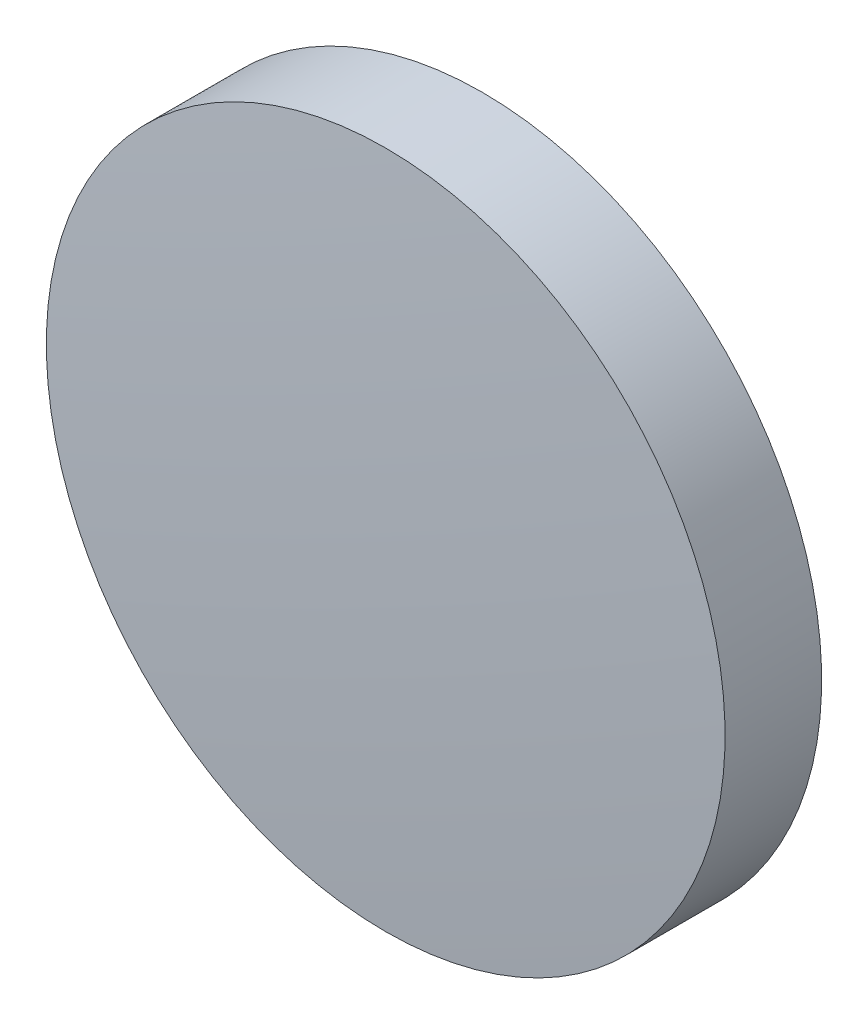
ISO-10303-21;
HEADER;
FILE_DESCRIPTION(('STEP AP214'),'2;1');
FILE_NAME('part.step','',(''),(''),'','','');
FILE_SCHEMA(('AUTOMOTIVE_DESIGN { 1 0 10303 214 1 1 1 1 }'));
ENDSEC;
DATA;
#1=APPLICATION_CONTEXT('core data for automotive mechanical design processes');
#2=APPLICATION_PROTOCOL_DEFINITION('international standard','automotive_design',2000,#1);
#3=PRODUCT_CONTEXT('',#1,'mechanical');
#4=PRODUCT('Part','Part','',(#3));
#5=PRODUCT_RELATED_PRODUCT_CATEGORY('part','',(#4));
#6=PRODUCT_DEFINITION_FORMATION('','',#4);
#7=PRODUCT_DEFINITION_CONTEXT('part definition',#1,'design');
#8=PRODUCT_DEFINITION('design','',#6,#7);
#9=PRODUCT_DEFINITION_SHAPE('','',#8);
#10=(LENGTH_UNIT() NAMED_UNIT(*) SI_UNIT(.MILLI.,.METRE.));
#11=(NAMED_UNIT(*) PLANE_ANGLE_UNIT() SI_UNIT($,.RADIAN.));
#12=(NAMED_UNIT(*) SI_UNIT($,.STERADIAN.) SOLID_ANGLE_UNIT());
#13=UNCERTAINTY_MEASURE_WITH_UNIT(LENGTH_MEASURE(1.E-05),#10,'distance_accuracy_value','');
#14=(GEOMETRIC_REPRESENTATION_CONTEXT(3) GLOBAL_UNCERTAINTY_ASSIGNED_CONTEXT((#13)) GLOBAL_UNIT_ASSIGNED_CONTEXT((#10,
#11,#12)) REPRESENTATION_CONTEXT('',''));
#15=CARTESIAN_POINT('',(0.,0.,0.));
#16=DIRECTION('',(0.,0.,1.));
#17=DIRECTION('',(1.,0.,0.));
#18=AXIS2_PLACEMENT_3D('',#15,#16,#17);
#19=CARTESIAN_POINT('',(0.,0.,-2.));
#20=DIRECTION('',(0.,0.,-1.));
#21=DIRECTION('',(0.,1.,0.));
#22=AXIS2_PLACEMENT_3D('',#19,#20,#21);
#23=PLANE('',#22);
#24=CARTESIAN_POINT('',(0.,0.,-2.));
#25=DIRECTION('',(0.,0.,-1.));
#26=DIRECTION('',(0.,1.,0.));
#27=AXIS2_PLACEMENT_3D('',#24,#25,#26);
#28=CIRCLE('',#27,12.7);
#29=CARTESIAN_POINT('',(0.,12.7,-2.));
#30=VERTEX_POINT('',#29);
#31=EDGE_CURVE('E36',#30,#30,#28,.T.);
#32=ORIENTED_EDGE('',*,*,#31,.T.);
#33=EDGE_LOOP('',(#32));
#34=FACE_BOUND('',#33,.T.);
#35=ADVANCED_FACE('F30',(#34),#23,.T.);
#36=CARTESIAN_POINT('',(0.,0.,-207.));
#37=DIRECTION('',(0.,0.,-1.));
#38=DIRECTION('',(0.,1.,0.));
#39=AXIS2_PLACEMENT_3D('',#36,#37,#38);
#40=SPHERICAL_SURFACE('',#39,209.);
#41=CARTESIAN_POINT('',(0.,0.,1.61378190330588));
#42=DIRECTION('',(0.,0.,-1.));
#43=DIRECTION('',(0.,1.,0.));
#44=AXIS2_PLACEMENT_3D('',#41,#42,#43);
#45=CIRCLE('',#44,12.7);
#46=CARTESIAN_POINT('',(0.,12.7,1.61378190330588));
#47=VERTEX_POINT('',#46);
#48=EDGE_CURVE('E10',#47,#47,#45,.T.);
#49=ORIENTED_EDGE('',*,*,#48,.F.);
#50=EDGE_LOOP('',(#49));
#51=FACE_BOUND('',#50,.T.);
#52=ADVANCED_FACE('F45',(#51),#40,.T.);
#53=CARTESIAN_POINT('',(0.,0.,-2.));
#54=DIRECTION('',(0.,0.,-1.));
#55=DIRECTION('',(0.,1.,0.));
#56=AXIS2_PLACEMENT_3D('',#53,#54,#55);
#57=CYLINDRICAL_SURFACE('',#56,12.7);
#58=ORIENTED_EDGE('',*,*,#48,.T.);
#59=EDGE_LOOP('',(#58));
#60=FACE_BOUND('',#59,.T.);
#61=ORIENTED_EDGE('',*,*,#31,.F.);
#62=EDGE_LOOP('',(#61));
#63=FACE_BOUND('',#62,.T.);
#64=ADVANCED_FACE('F43',(#60,#63),#57,.T.);
#65=CLOSED_SHELL('',(#35,#52,#64));
#66=MANIFOLD_SOLID_BREP('B2',#65);
#67=ADVANCED_BREP_SHAPE_REPRESENTATION('',(#18,#66),#14);
#68=SHAPE_DEFINITION_REPRESENTATION(#9,#67);
ENDSEC;
END-ISO-10303-21;
